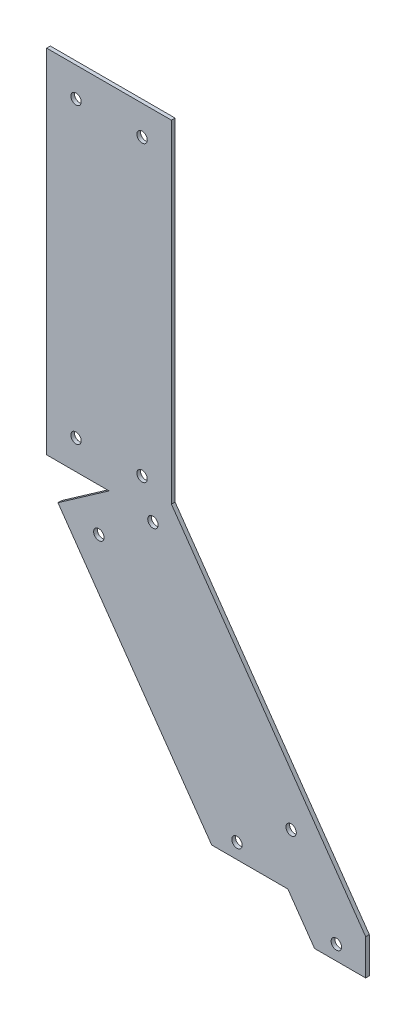
ISO-10303-21;
HEADER;
FILE_DESCRIPTION(('STEP AP214'),'2;1');
FILE_NAME('part.step','',(''),(''),'','','');
FILE_SCHEMA(('AUTOMOTIVE_DESIGN { 1 0 10303 214 1 1 1 1 }'));
ENDSEC;
DATA;
#1=APPLICATION_CONTEXT('core data for automotive mechanical design processes');
#2=APPLICATION_PROTOCOL_DEFINITION('international standard','automotive_design',2000,#1);
#3=PRODUCT_CONTEXT('',#1,'mechanical');
#4=PRODUCT('Part','Part','',(#3));
#5=PRODUCT_RELATED_PRODUCT_CATEGORY('part','',(#4));
#6=PRODUCT_DEFINITION_FORMATION('','',#4);
#7=PRODUCT_DEFINITION_CONTEXT('part definition',#1,'design');
#8=PRODUCT_DEFINITION('design','',#6,#7);
#9=PRODUCT_DEFINITION_SHAPE('','',#8);
#10=(LENGTH_UNIT() NAMED_UNIT(*) SI_UNIT(.MILLI.,.METRE.));
#11=(NAMED_UNIT(*) PLANE_ANGLE_UNIT() SI_UNIT($,.RADIAN.));
#12=(NAMED_UNIT(*) SI_UNIT($,.STERADIAN.) SOLID_ANGLE_UNIT());
#13=UNCERTAINTY_MEASURE_WITH_UNIT(LENGTH_MEASURE(1.E-05),#10,'distance_accuracy_value','');
#14=(GEOMETRIC_REPRESENTATION_CONTEXT(3) GLOBAL_UNCERTAINTY_ASSIGNED_CONTEXT((#13)) GLOBAL_UNIT_ASSIGNED_CONTEXT((#10,
#11,#12)) REPRESENTATION_CONTEXT('',''));
#15=CARTESIAN_POINT('',(0.,0.,0.));
#16=DIRECTION('',(0.,0.,1.));
#17=DIRECTION('',(1.,0.,0.));
#18=AXIS2_PLACEMENT_3D('',#15,#16,#17);
#19=CARTESIAN_POINT('',(22.1068657952492,15.4793940760237,1.5875));
#20=DIRECTION('',(-0.819152044288995,-0.573576436351042,0.));
#21=DIRECTION('',(0.573576436351042,-0.819152044288995,0.));
#22=AXIS2_PLACEMENT_3D('',#19,#20,#21);
#23=PLANE('',#22);
#24=DIRECTION('',(-0.573576436351042,0.819152044288995,0.));
#25=VECTOR('',#24,1.);
#26=CARTESIAN_POINT('',(22.1068657952492,15.4793940760237,0.));
#27=LINE('',#26,#25);
#28=CARTESIAN_POINT('',(111.033223147881,-111.520605923976,0.));
#29=VERTEX_POINT('',#28);
#30=CARTESIAN_POINT('',(26.9875,8.50912606487149,0.));
#31=VERTEX_POINT('',#30);
#32=EDGE_CURVE('E182',#29,#31,#27,.T.);
#33=ORIENTED_EDGE('',*,*,#32,.T.);
#34=DIRECTION('',(0.,0.,-1.));
#35=VECTOR('',#34,1.);
#36=CARTESIAN_POINT('',(26.9875,8.50912606487149,1.5875));
#37=LINE('',#36,#35);
#38=CARTESIAN_POINT('',(26.9875,8.50912606487149,1.5875));
#39=VERTEX_POINT('',#38);
#40=EDGE_CURVE('E11',#39,#31,#37,.T.);
#41=ORIENTED_EDGE('',*,*,#40,.F.);
#42=DIRECTION('',(-0.573576436351042,0.819152044288995,0.));
#43=VECTOR('',#42,1.);
#44=CARTESIAN_POINT('',(22.1068657952492,15.4793940760237,1.5875));
#45=LINE('',#44,#43);
#46=CARTESIAN_POINT('',(111.033223147881,-111.520605923976,1.5875));
#47=VERTEX_POINT('',#46);
#48=EDGE_CURVE('E106',#47,#39,#45,.T.);
#49=ORIENTED_EDGE('',*,*,#48,.F.);
#50=DIRECTION('',(0.,0.,-1.));
#51=VECTOR('',#50,1.);
#52=CARTESIAN_POINT('',(111.033223147881,-111.520605923976,1.5875));
#53=LINE('',#52,#51);
#54=EDGE_CURVE('E181',#47,#29,#53,.T.);
#55=ORIENTED_EDGE('',*,*,#54,.T.);
#56=EDGE_LOOP('',(#33,#41,#49,#55));
#57=FACE_BOUND('',#56,.T.);
#58=ADVANCED_FACE('F41',(#57),#23,.F.);
#59=CARTESIAN_POINT('',(26.9875,0.,1.5875));
#60=DIRECTION('',(1.,0.,0.));
#61=DIRECTION('',(0.,0.,-1.));
#62=AXIS2_PLACEMENT_3D('',#59,#60,#61);
#63=PLANE('',#62);
#64=DIRECTION('',(0.,-1.,0.));
#65=VECTOR('',#64,1.);
#66=CARTESIAN_POINT('',(26.9875,0.,0.));
#67=LINE('',#66,#65);
#68=CARTESIAN_POINT('',(26.9875,152.4,0.));
#69=VERTEX_POINT('',#68);
#70=EDGE_CURVE('E185',#69,#31,#67,.T.);
#71=ORIENTED_EDGE('',*,*,#70,.F.);
#72=DIRECTION('',(0.,0.,-1.));
#73=VECTOR('',#72,1.);
#74=CARTESIAN_POINT('',(26.9875,152.4,1.5875));
#75=LINE('',#74,#73);
#76=CARTESIAN_POINT('',(26.9875,152.4,1.5875));
#77=VERTEX_POINT('',#76);
#78=EDGE_CURVE('E49',#77,#69,#75,.T.);
#79=ORIENTED_EDGE('',*,*,#78,.F.);
#80=DIRECTION('',(0.,-1.,0.));
#81=VECTOR('',#80,1.);
#82=CARTESIAN_POINT('',(26.9875,0.,1.5875));
#83=LINE('',#82,#81);
#84=EDGE_CURVE('E273',#77,#39,#83,.T.);
#85=ORIENTED_EDGE('',*,*,#84,.T.);
#86=ORIENTED_EDGE('',*,*,#40,.T.);
#87=EDGE_LOOP('',(#71,#79,#85,#86));
#88=FACE_BOUND('',#87,.T.);
#89=ADVANCED_FACE('F256',(#88),#63,.T.);
#90=CARTESIAN_POINT('',(0.,152.4,1.5875));
#91=DIRECTION('',(0.,1.,0.));
#92=DIRECTION('',(0.,0.,1.));
#93=AXIS2_PLACEMENT_3D('',#90,#91,#92);
#94=PLANE('',#93);
#95=DIRECTION('',(1.,0.,0.));
#96=VECTOR('',#95,1.);
#97=CARTESIAN_POINT('',(0.,152.4,0.));
#98=LINE('',#97,#96);
#99=CARTESIAN_POINT('',(-26.9875,152.4,0.));
#100=VERTEX_POINT('',#99);
#101=EDGE_CURVE('E188',#100,#69,#98,.T.);
#102=ORIENTED_EDGE('',*,*,#101,.F.);
#103=DIRECTION('',(0.,0.,-1.));
#104=VECTOR('',#103,1.);
#105=CARTESIAN_POINT('',(-26.9875,152.4,1.5875));
#106=LINE('',#105,#104);
#107=CARTESIAN_POINT('',(-26.9875,152.4,1.5875));
#108=VERTEX_POINT('',#107);
#109=EDGE_CURVE('E246',#108,#100,#106,.T.);
#110=ORIENTED_EDGE('',*,*,#109,.F.);
#111=DIRECTION('',(1.,0.,0.));
#112=VECTOR('',#111,1.);
#113=CARTESIAN_POINT('',(0.,152.4,1.5875));
#114=LINE('',#113,#112);
#115=EDGE_CURVE('E253',#108,#77,#114,.T.);
#116=ORIENTED_EDGE('',*,*,#115,.T.);
#117=ORIENTED_EDGE('',*,*,#78,.T.);
#118=EDGE_LOOP('',(#102,#110,#116,#117));
#119=FACE_BOUND('',#118,.T.);
#120=ADVANCED_FACE('F251',(#119),#94,.T.);
#121=CARTESIAN_POINT('',(-26.9875,0.,1.5875));
#122=DIRECTION('',(1.,0.,0.));
#123=DIRECTION('',(0.,0.,-1.));
#124=AXIS2_PLACEMENT_3D('',#121,#122,#123);
#125=PLANE('',#124);
#126=DIRECTION('',(0.,-1.,0.));
#127=VECTOR('',#126,1.);
#128=CARTESIAN_POINT('',(-26.9875,0.,0.));
#129=LINE('',#128,#127);
#130=CARTESIAN_POINT('',(-26.9875,0.,0.));
#131=VERTEX_POINT('',#130);
#132=EDGE_CURVE('E191',#100,#131,#129,.T.);
#133=ORIENTED_EDGE('',*,*,#132,.T.);
#134=DIRECTION('',(0.,0.,-1.));
#135=VECTOR('',#134,1.);
#136=CARTESIAN_POINT('',(-26.9875,0.,1.5875));
#137=LINE('',#136,#135);
#138=CARTESIAN_POINT('',(-26.9875,0.,1.5875));
#139=VERTEX_POINT('',#138);
#140=EDGE_CURVE('E244',#139,#131,#137,.T.);
#141=ORIENTED_EDGE('',*,*,#140,.F.);
#142=DIRECTION('',(0.,-1.,0.));
#143=VECTOR('',#142,1.);
#144=CARTESIAN_POINT('',(-26.9875,0.,1.5875));
#145=LINE('',#144,#143);
#146=EDGE_CURVE('E269',#108,#139,#145,.T.);
#147=ORIENTED_EDGE('',*,*,#146,.F.);
#148=ORIENTED_EDGE('',*,*,#109,.T.);
#149=EDGE_LOOP('',(#133,#141,#147,#148));
#150=FACE_BOUND('',#149,.T.);
#151=ADVANCED_FACE('F266',(#150),#125,.F.);
#152=CARTESIAN_POINT('',(0.,0.,1.5875));
#153=DIRECTION('',(0.,-1.,0.));
#154=DIRECTION('',(1.,0.,0.));
#155=AXIS2_PLACEMENT_3D('',#152,#153,#154);
#156=PLANE('',#155);
#157=DIRECTION('',(-1.,0.,0.));
#158=VECTOR('',#157,1.);
#159=CARTESIAN_POINT('',(0.,0.,0.));
#160=LINE('',#159,#158);
#161=CARTESIAN_POINT('',(0.,0.,0.));
#162=VERTEX_POINT('',#161);
#163=EDGE_CURVE('E194',#162,#131,#160,.T.);
#164=ORIENTED_EDGE('',*,*,#163,.F.);
#165=DIRECTION('',(0.,0.,-1.));
#166=VECTOR('',#165,1.);
#167=CARTESIAN_POINT('',(0.,0.,1.5875));
#168=LINE('',#167,#166);
#169=CARTESIAN_POINT('',(0.,0.,1.5875));
#170=VERTEX_POINT('',#169);
#171=EDGE_CURVE('E242',#170,#162,#168,.T.);
#172=ORIENTED_EDGE('',*,*,#171,.F.);
#173=DIRECTION('',(-1.,0.,0.));
#174=VECTOR('',#173,1.);
#175=CARTESIAN_POINT('',(0.,0.,1.5875));
#176=LINE('',#175,#174);
#177=EDGE_CURVE('E271',#170,#139,#176,.T.);
#178=ORIENTED_EDGE('',*,*,#177,.T.);
#179=ORIENTED_EDGE('',*,*,#140,.T.);
#180=EDGE_LOOP('',(#164,#172,#178,#179));
#181=FACE_BOUND('',#180,.T.);
#182=ADVANCED_FACE('F319',(#181),#156,.T.);
#183=CARTESIAN_POINT('',(0.,0.,1.5875));
#184=DIRECTION('',(0.573576436351042,-0.819152044288995,0.));
#185=DIRECTION('',(0.819152044288995,0.573576436351042,0.));
#186=AXIS2_PLACEMENT_3D('',#183,#184,#185);
#187=PLANE('',#186);
#188=DIRECTION('',(-0.819152044288995,-0.573576436351042,0.));
#189=VECTOR('',#188,1.);
#190=CARTESIAN_POINT('',(0.,0.,0.));
#191=LINE('',#190,#189);
#192=CARTESIAN_POINT('',(-22.1068657952493,-15.4793940760237,0.));
#193=VERTEX_POINT('',#192);
#194=EDGE_CURVE('E197',#162,#193,#191,.T.);
#195=ORIENTED_EDGE('',*,*,#194,.T.);
#196=DIRECTION('',(0.,0.,-1.));
#197=VECTOR('',#196,1.);
#198=CARTESIAN_POINT('',(-22.1068657952493,-15.4793940760237,1.5875));
#199=LINE('',#198,#197);
#200=CARTESIAN_POINT('',(-22.1068657952493,-15.4793940760237,1.5875));
#201=VERTEX_POINT('',#200);
#202=EDGE_CURVE('E239',#201,#193,#199,.T.);
#203=ORIENTED_EDGE('',*,*,#202,.F.);
#204=DIRECTION('',(-0.819152044288995,-0.573576436351042,0.));
#205=VECTOR('',#204,1.);
#206=CARTESIAN_POINT('',(0.,0.,1.5875));
#207=LINE('',#206,#205);
#208=EDGE_CURVE('E279',#170,#201,#207,.T.);
#209=ORIENTED_EDGE('',*,*,#208,.F.);
#210=ORIENTED_EDGE('',*,*,#171,.T.);
#211=EDGE_LOOP('',(#195,#203,#209,#210));
#212=FACE_BOUND('',#211,.T.);
#213=ADVANCED_FACE('F322',(#212),#187,.F.);
#214=CARTESIAN_POINT('',(-22.1068657952493,-15.4793940760237,1.5875));
#215=DIRECTION('',(0.819152044288995,0.573576436351042,0.));
#216=DIRECTION('',(-0.573576436351042,0.819152044288995,0.));
#217=AXIS2_PLACEMENT_3D('',#214,#215,#216);
#218=PLANE('',#217);
#219=DIRECTION('',(0.573576436351042,-0.819152044288995,0.));
#220=VECTOR('',#219,1.);
#221=CARTESIAN_POINT('',(-22.1068657952493,-15.4793940760237,0.));
#222=LINE('',#221,#220);
#223=CARTESIAN_POINT('',(44.4202766825903,-110.49,0.));
#224=VERTEX_POINT('',#223);
#225=EDGE_CURVE('E199',#193,#224,#222,.T.);
#226=ORIENTED_EDGE('',*,*,#225,.T.);
#227=DIRECTION('',(0.,0.,-1.));
#228=VECTOR('',#227,1.);
#229=CARTESIAN_POINT('',(44.4202766825903,-110.49,1.5875));
#230=LINE('',#229,#228);
#231=CARTESIAN_POINT('',(44.4202766825903,-110.49,1.5875));
#232=VERTEX_POINT('',#231);
#233=EDGE_CURVE('E236',#232,#224,#230,.T.);
#234=ORIENTED_EDGE('',*,*,#233,.F.);
#235=DIRECTION('',(0.573576436351042,-0.819152044288995,0.));
#236=VECTOR('',#235,1.);
#237=CARTESIAN_POINT('',(-22.1068657952493,-15.4793940760237,1.5875));
#238=LINE('',#237,#236);
#239=EDGE_CURVE('E281',#201,#232,#238,.T.);
#240=ORIENTED_EDGE('',*,*,#239,.F.);
#241=ORIENTED_EDGE('',*,*,#202,.T.);
#242=EDGE_LOOP('',(#226,#234,#240,#241));
#243=FACE_BOUND('',#242,.T.);
#244=ADVANCED_FACE('F287',(#243),#218,.F.);
#245=CARTESIAN_POINT('',(0.,-110.49,1.5875));
#246=DIRECTION('',(0.,1.,0.));
#247=DIRECTION('',(0.,0.,1.));
#248=AXIS2_PLACEMENT_3D('',#245,#246,#247);
#249=PLANE('',#248);
#250=DIRECTION('',(1.,0.,0.));
#251=VECTOR('',#250,1.);
#252=CARTESIAN_POINT('',(0.,-110.49,0.));
#253=LINE('',#252,#251);
#254=CARTESIAN_POINT('',(77.36593089679,-110.49,0.));
#255=VERTEX_POINT('',#254);
#256=EDGE_CURVE('E201',#224,#255,#253,.T.);
#257=ORIENTED_EDGE('',*,*,#256,.T.);
#258=DIRECTION('',(0.,0.,-1.));
#259=VECTOR('',#258,1.);
#260=CARTESIAN_POINT('',(77.36593089679,-110.49,1.5875));
#261=LINE('',#260,#259);
#262=CARTESIAN_POINT('',(77.36593089679,-110.49,1.5875));
#263=VERTEX_POINT('',#262);
#264=EDGE_CURVE('E146',#263,#255,#261,.T.);
#265=ORIENTED_EDGE('',*,*,#264,.F.);
#266=DIRECTION('',(1.,0.,0.));
#267=VECTOR('',#266,1.);
#268=CARTESIAN_POINT('',(0.,-110.49,1.5875));
#269=LINE('',#268,#267);
#270=EDGE_CURVE('E137',#232,#263,#269,.T.);
#271=ORIENTED_EDGE('',*,*,#270,.F.);
#272=ORIENTED_EDGE('',*,*,#233,.T.);
#273=EDGE_LOOP('',(#257,#265,#271,#272));
#274=FACE_BOUND('',#273,.T.);
#275=ADVANCED_FACE('F291',(#274),#249,.F.);
#276=CARTESIAN_POINT('',(0.,0.,1.5875));
#277=DIRECTION('',(0.819152044288995,0.573576436351042,0.));
#278=DIRECTION('',(-0.573576436351042,0.819152044288995,0.));
#279=AXIS2_PLACEMENT_3D('',#276,#277,#278);
#280=PLANE('',#279);
#281=DIRECTION('',(0.573576436351042,-0.819152044288995,0.));
#282=VECTOR('',#281,1.);
#283=CARTESIAN_POINT('',(0.,0.,0.));
#284=LINE('',#283,#282);
#285=CARTESIAN_POINT('',(88.9263573526322,-127.,0.));
#286=VERTEX_POINT('',#285);
#287=EDGE_CURVE('E145',#255,#286,#284,.T.);
#288=ORIENTED_EDGE('',*,*,#287,.T.);
#289=DIRECTION('',(0.,0.,-1.));
#290=VECTOR('',#289,1.);
#291=CARTESIAN_POINT('',(88.9263573526322,-127.,1.5875));
#292=LINE('',#291,#290);
#293=CARTESIAN_POINT('',(88.9263573526322,-127.,1.5875));
#294=VERTEX_POINT('',#293);
#295=EDGE_CURVE('E142',#294,#286,#292,.T.);
#296=ORIENTED_EDGE('',*,*,#295,.F.);
#297=DIRECTION('',(0.573576436351042,-0.819152044288995,0.));
#298=VECTOR('',#297,1.);
#299=CARTESIAN_POINT('',(0.,0.,1.5875));
#300=LINE('',#299,#298);
#301=EDGE_CURVE('E130',#263,#294,#300,.T.);
#302=ORIENTED_EDGE('',*,*,#301,.F.);
#303=ORIENTED_EDGE('',*,*,#264,.T.);
#304=EDGE_LOOP('',(#288,#296,#302,#303));
#305=FACE_BOUND('',#304,.T.);
#306=ADVANCED_FACE('F143',(#305),#280,.F.);
#307=CARTESIAN_POINT('',(0.,-127.,1.5875));
#308=DIRECTION('',(0.,1.,0.));
#309=DIRECTION('',(0.,0.,1.));
#310=AXIS2_PLACEMENT_3D('',#307,#308,#309);
#311=PLANE('',#310);
#312=DIRECTION('',(1.,0.,0.));
#313=VECTOR('',#312,1.);
#314=CARTESIAN_POINT('',(0.,-127.,0.));
#315=LINE('',#314,#313);
#316=CARTESIAN_POINT('',(111.033223147881,-127.,0.));
#317=VERTEX_POINT('',#316);
#318=EDGE_CURVE('E94',#286,#317,#315,.T.);
#319=ORIENTED_EDGE('',*,*,#318,.T.);
#320=DIRECTION('',(0.,0.,-1.));
#321=VECTOR('',#320,1.);
#322=CARTESIAN_POINT('',(111.033223147881,-127.,1.5875));
#323=LINE('',#322,#321);
#324=CARTESIAN_POINT('',(111.033223147881,-127.,1.5875));
#325=VERTEX_POINT('',#324);
#326=EDGE_CURVE('E147',#325,#317,#323,.T.);
#327=ORIENTED_EDGE('',*,*,#326,.F.);
#328=DIRECTION('',(1.,0.,0.));
#329=VECTOR('',#328,1.);
#330=CARTESIAN_POINT('',(0.,-127.,1.5875));
#331=LINE('',#330,#329);
#332=EDGE_CURVE('E135',#294,#325,#331,.T.);
#333=ORIENTED_EDGE('',*,*,#332,.F.);
#334=ORIENTED_EDGE('',*,*,#295,.T.);
#335=EDGE_LOOP('',(#319,#327,#333,#334));
#336=FACE_BOUND('',#335,.T.);
#337=ADVANCED_FACE('F149',(#336),#311,.F.);
#338=CARTESIAN_POINT('',(-14.2875,12.7,1.5875));
#339=DIRECTION('',(0.,0.,-1.));
#340=DIRECTION('',(-1.,0.,0.));
#341=AXIS2_PLACEMENT_3D('',#338,#339,#340);
#342=CYLINDRICAL_SURFACE('',#341,2.25);
#343=CARTESIAN_POINT('',(-14.2875,12.7,1.5875));
#344=DIRECTION('',(0.,0.,1.));
#345=DIRECTION('',(1.,0.,0.));
#346=AXIS2_PLACEMENT_3D('',#343,#344,#345);
#347=CIRCLE('',#346,2.25);
#348=CARTESIAN_POINT('',(-12.0375,12.7,1.5875));
#349=VERTEX_POINT('',#348);
#350=EDGE_CURVE('E175',#349,#349,#347,.T.);
#351=ORIENTED_EDGE('',*,*,#350,.T.);
#352=EDGE_LOOP('',(#351));
#353=FACE_BOUND('',#352,.T.);
#354=CARTESIAN_POINT('',(-14.2875,12.7,0.));
#355=DIRECTION('',(0.,0.,1.));
#356=DIRECTION('',(1.,0.,0.));
#357=AXIS2_PLACEMENT_3D('',#354,#355,#356);
#358=CIRCLE('',#357,2.25);
#359=CARTESIAN_POINT('',(-12.0375,12.7,0.));
#360=VERTEX_POINT('',#359);
#361=EDGE_CURVE('E227',#360,#360,#358,.T.);
#362=ORIENTED_EDGE('',*,*,#361,.F.);
#363=EDGE_LOOP('',(#362));
#364=FACE_BOUND('',#363,.T.);
#365=ADVANCED_FACE('F333',(#353,#364),#342,.F.);
#366=CARTESIAN_POINT('',(14.2875,139.7,1.5875));
#367=DIRECTION('',(0.,0.,-1.));
#368=DIRECTION('',(-1.,0.,0.));
#369=AXIS2_PLACEMENT_3D('',#366,#367,#368);
#370=CYLINDRICAL_SURFACE('',#369,2.25);
#371=CARTESIAN_POINT('',(14.2875,139.7,1.5875));
#372=DIRECTION('',(0.,0.,1.));
#373=DIRECTION('',(1.,0.,0.));
#374=AXIS2_PLACEMENT_3D('',#371,#372,#373);
#375=CIRCLE('',#374,2.25);
#376=CARTESIAN_POINT('',(16.5375,139.7,1.5875));
#377=VERTEX_POINT('',#376);
#378=EDGE_CURVE('E172',#377,#377,#375,.F.);
#379=ORIENTED_EDGE('',*,*,#378,.F.);
#380=EDGE_LOOP('',(#379));
#381=FACE_BOUND('',#380,.T.);
#382=CARTESIAN_POINT('',(14.2875,139.7,0.));
#383=DIRECTION('',(0.,0.,1.));
#384=DIRECTION('',(1.,0.,0.));
#385=AXIS2_PLACEMENT_3D('',#382,#383,#384);
#386=CIRCLE('',#385,2.25);
#387=CARTESIAN_POINT('',(16.5375,139.7,0.));
#388=VERTEX_POINT('',#387);
#389=EDGE_CURVE('E224',#388,#388,#386,.F.);
#390=ORIENTED_EDGE('',*,*,#389,.T.);
#391=EDGE_LOOP('',(#390));
#392=FACE_BOUND('',#391,.T.);
#393=ADVANCED_FACE('F337',(#381,#392),#370,.F.);
#394=CARTESIAN_POINT('',(-4.41921409112079,-18.5982042968357,1.5875));
#395=DIRECTION('',(0.,0.,-1.));
#396=DIRECTION('',(-1.,0.,0.));
#397=AXIS2_PLACEMENT_3D('',#394,#395,#396);
#398=CYLINDRICAL_SURFACE('',#397,2.25);
#399=CARTESIAN_POINT('',(-4.41921409112079,-18.5982042968357,1.5875));
#400=DIRECTION('',(0.,0.,1.));
#401=DIRECTION('',(1.,0.,0.));
#402=AXIS2_PLACEMENT_3D('',#399,#400,#401);
#403=CIRCLE('',#402,2.25);
#404=CARTESIAN_POINT('',(-2.16921409112079,-18.5982042968357,1.5875));
#405=VERTEX_POINT('',#404);
#406=EDGE_CURVE('E169',#405,#405,#403,.T.);
#407=ORIENTED_EDGE('',*,*,#406,.T.);
#408=EDGE_LOOP('',(#407));
#409=FACE_BOUND('',#408,.T.);
#410=CARTESIAN_POINT('',(-4.41921409112079,-18.5982042968357,0.));
#411=DIRECTION('',(0.,0.,1.));
#412=DIRECTION('',(1.,0.,0.));
#413=AXIS2_PLACEMENT_3D('',#410,#411,#412);
#414=CIRCLE('',#413,2.25);
#415=CARTESIAN_POINT('',(-2.16921409112079,-18.5982042968357,0.));
#416=VERTEX_POINT('',#415);
#417=EDGE_CURVE('E221',#416,#416,#414,.T.);
#418=ORIENTED_EDGE('',*,*,#417,.F.);
#419=EDGE_LOOP('',(#418));
#420=FACE_BOUND('',#419,.T.);
#421=ADVANCED_FACE('F343',(#409,#420),#398,.F.);
#422=CARTESIAN_POINT('',(55.3694602948785,-103.985280446955,1.5875));
#423=DIRECTION('',(0.,0.,-1.));
#424=DIRECTION('',(-1.,0.,0.));
#425=AXIS2_PLACEMENT_3D('',#422,#423,#424);
#426=CYLINDRICAL_SURFACE('',#425,2.25);
#427=CARTESIAN_POINT('',(55.3694602948785,-103.985280446955,1.5875));
#428=DIRECTION('',(0.,0.,1.));
#429=DIRECTION('',(1.,0.,0.));
#430=AXIS2_PLACEMENT_3D('',#427,#428,#429);
#431=CIRCLE('',#430,2.25);
#432=CARTESIAN_POINT('',(57.6194602948785,-103.985280446955,1.5875));
#433=VERTEX_POINT('',#432);
#434=EDGE_CURVE('E166',#433,#433,#431,.T.);
#435=ORIENTED_EDGE('',*,*,#434,.T.);
#436=EDGE_LOOP('',(#435));
#437=FACE_BOUND('',#436,.T.);
#438=CARTESIAN_POINT('',(55.3694602948785,-103.985280446955,0.));
#439=DIRECTION('',(0.,0.,1.));
#440=DIRECTION('',(1.,0.,0.));
#441=AXIS2_PLACEMENT_3D('',#438,#439,#440);
#442=CIRCLE('',#441,2.25);
#443=CARTESIAN_POINT('',(57.6194602948785,-103.985280446955,0.));
#444=VERTEX_POINT('',#443);
#445=EDGE_CURVE('E218',#444,#444,#442,.T.);
#446=ORIENTED_EDGE('',*,*,#445,.F.);
#447=EDGE_LOOP('',(#446));
#448=FACE_BOUND('',#447,.T.);
#449=ADVANCED_FACE('F351',(#437,#448),#426,.F.);
#450=CARTESIAN_POINT('',(78.7767299604365,-87.5953337782238,1.5875));
#451=DIRECTION('',(0.,0.,-1.));
#452=DIRECTION('',(-1.,0.,0.));
#453=AXIS2_PLACEMENT_3D('',#450,#451,#452);
#454=CYLINDRICAL_SURFACE('',#453,2.25000000000001);
#455=CARTESIAN_POINT('',(78.7767299604365,-87.5953337782238,1.5875));
#456=DIRECTION('',(0.,0.,1.));
#457=DIRECTION('',(1.,0.,0.));
#458=AXIS2_PLACEMENT_3D('',#455,#456,#457);
#459=CIRCLE('',#458,2.25000000000001);
#460=CARTESIAN_POINT('',(81.0267299604365,-87.5953337782238,1.5875));
#461=VERTEX_POINT('',#460);
#462=EDGE_CURVE('E163',#461,#461,#459,.F.);
#463=ORIENTED_EDGE('',*,*,#462,.F.);
#464=EDGE_LOOP('',(#463));
#465=FACE_BOUND('',#464,.T.);
#466=CARTESIAN_POINT('',(78.7767299604365,-87.5953337782238,0.));
#467=DIRECTION('',(0.,0.,1.));
#468=DIRECTION('',(1.,0.,0.));
#469=AXIS2_PLACEMENT_3D('',#466,#467,#468);
#470=CIRCLE('',#469,2.25000000000001);
#471=CARTESIAN_POINT('',(81.0267299604365,-87.5953337782238,0.));
#472=VERTEX_POINT('',#471);
#473=EDGE_CURVE('E215',#472,#472,#470,.F.);
#474=ORIENTED_EDGE('',*,*,#473,.T.);
#475=EDGE_LOOP('',(#474));
#476=FACE_BOUND('',#475,.T.);
#477=ADVANCED_FACE('F355',(#465,#476),#454,.F.);
#478=CARTESIAN_POINT('',(18.9880555744372,-2.20825762810472,1.5875));
#479=DIRECTION('',(0.,0.,-1.));
#480=DIRECTION('',(-1.,0.,0.));
#481=AXIS2_PLACEMENT_3D('',#478,#479,#480);
#482=CYLINDRICAL_SURFACE('',#481,2.25);
#483=CARTESIAN_POINT('',(18.9880555744372,-2.20825762810472,1.5875));
#484=DIRECTION('',(0.,0.,1.));
#485=DIRECTION('',(1.,0.,0.));
#486=AXIS2_PLACEMENT_3D('',#483,#484,#485);
#487=CIRCLE('',#486,2.25);
#488=CARTESIAN_POINT('',(21.2380555744372,-2.20825762810472,1.5875));
#489=VERTEX_POINT('',#488);
#490=EDGE_CURVE('E160',#489,#489,#487,.F.);
#491=ORIENTED_EDGE('',*,*,#490,.F.);
#492=EDGE_LOOP('',(#491));
#493=FACE_BOUND('',#492,.T.);
#494=CARTESIAN_POINT('',(18.9880555744372,-2.20825762810472,0.));
#495=DIRECTION('',(0.,0.,1.));
#496=DIRECTION('',(1.,0.,0.));
#497=AXIS2_PLACEMENT_3D('',#494,#495,#496);
#498=CIRCLE('',#497,2.25);
#499=CARTESIAN_POINT('',(21.2380555744372,-2.20825762810472,0.));
#500=VERTEX_POINT('',#499);
#501=EDGE_CURVE('E212',#500,#500,#498,.F.);
#502=ORIENTED_EDGE('',*,*,#501,.T.);
#503=EDGE_LOOP('',(#502));
#504=FACE_BOUND('',#503,.T.);
#505=ADVANCED_FACE('F359',(#493,#504),#482,.F.);
#506=CARTESIAN_POINT('',(98.3332231478814,-120.65,1.5875));
#507=DIRECTION('',(0.,0.,-1.));
#508=DIRECTION('',(-1.,0.,0.));
#509=AXIS2_PLACEMENT_3D('',#506,#507,#508);
#510=CYLINDRICAL_SURFACE('',#509,2.25);
#511=CARTESIAN_POINT('',(98.3332231478814,-120.65,1.5875));
#512=DIRECTION('',(0.,0.,1.));
#513=DIRECTION('',(1.,0.,0.));
#514=AXIS2_PLACEMENT_3D('',#511,#512,#513);
#515=CIRCLE('',#514,2.25);
#516=CARTESIAN_POINT('',(100.583223147881,-120.65,1.5875));
#517=VERTEX_POINT('',#516);
#518=EDGE_CURVE('E157',#517,#517,#515,.T.);
#519=ORIENTED_EDGE('',*,*,#518,.T.);
#520=EDGE_LOOP('',(#519));
#521=FACE_BOUND('',#520,.T.);
#522=CARTESIAN_POINT('',(98.3332231478814,-120.65,0.));
#523=DIRECTION('',(0.,0.,1.));
#524=DIRECTION('',(1.,0.,0.));
#525=AXIS2_PLACEMENT_3D('',#522,#523,#524);
#526=CIRCLE('',#525,2.25);
#527=CARTESIAN_POINT('',(100.583223147881,-120.65,0.));
#528=VERTEX_POINT('',#527);
#529=EDGE_CURVE('E209',#528,#528,#526,.T.);
#530=ORIENTED_EDGE('',*,*,#529,.F.);
#531=EDGE_LOOP('',(#530));
#532=FACE_BOUND('',#531,.T.);
#533=ADVANCED_FACE('F304',(#521,#532),#510,.F.);
#534=CARTESIAN_POINT('',(14.2875,12.7,1.5875));
#535=DIRECTION('',(0.,0.,-1.));
#536=DIRECTION('',(-1.,0.,0.));
#537=AXIS2_PLACEMENT_3D('',#534,#535,#536);
#538=CYLINDRICAL_SURFACE('',#537,2.25);
#539=CARTESIAN_POINT('',(14.2875,12.7,1.5875));
#540=DIRECTION('',(0.,0.,1.));
#541=DIRECTION('',(1.,0.,0.));
#542=AXIS2_PLACEMENT_3D('',#539,#540,#541);
#543=CIRCLE('',#542,2.25);
#544=CARTESIAN_POINT('',(16.5375,12.7,1.5875));
#545=VERTEX_POINT('',#544);
#546=EDGE_CURVE('E151',#545,#545,#543,.F.);
#547=ORIENTED_EDGE('',*,*,#546,.F.);
#548=EDGE_LOOP('',(#547));
#549=FACE_BOUND('',#548,.T.);
#550=CARTESIAN_POINT('',(14.2875,12.7,0.));
#551=DIRECTION('',(0.,0.,1.));
#552=DIRECTION('',(1.,0.,0.));
#553=AXIS2_PLACEMENT_3D('',#550,#551,#552);
#554=CIRCLE('',#553,2.25);
#555=CARTESIAN_POINT('',(16.5375,12.7,0.));
#556=VERTEX_POINT('',#555);
#557=EDGE_CURVE('E206',#556,#556,#554,.F.);
#558=ORIENTED_EDGE('',*,*,#557,.T.);
#559=EDGE_LOOP('',(#558));
#560=FACE_BOUND('',#559,.T.);
#561=ADVANCED_FACE('F296',(#549,#560),#538,.F.);
#562=CARTESIAN_POINT('',(111.033223147881,0.,1.5875));
#563=DIRECTION('',(-1.,0.,0.));
#564=DIRECTION('',(0.,0.,1.));
#565=AXIS2_PLACEMENT_3D('',#562,#563,#564);
#566=PLANE('',#565);
#567=DIRECTION('',(0.,1.,0.));
#568=VECTOR('',#567,1.);
#569=CARTESIAN_POINT('',(111.033223147881,0.,0.));
#570=LINE('',#569,#568);
#571=EDGE_CURVE('E100',#317,#29,#570,.T.);
#572=ORIENTED_EDGE('',*,*,#571,.T.);
#573=ORIENTED_EDGE('',*,*,#54,.F.);
#574=DIRECTION('',(0.,1.,0.));
#575=VECTOR('',#574,1.);
#576=CARTESIAN_POINT('',(111.033223147881,0.,1.5875));
#577=LINE('',#576,#575);
#578=EDGE_CURVE('E57',#325,#47,#577,.T.);
#579=ORIENTED_EDGE('',*,*,#578,.F.);
#580=ORIENTED_EDGE('',*,*,#326,.T.);
#581=EDGE_LOOP('',(#572,#573,#579,#580));
#582=FACE_BOUND('',#581,.T.);
#583=ADVANCED_FACE('F293',(#582),#566,.F.);
#584=CARTESIAN_POINT('',(-14.2875,139.7,1.5875));
#585=DIRECTION('',(0.,0.,-1.));
#586=DIRECTION('',(-1.,0.,0.));
#587=AXIS2_PLACEMENT_3D('',#584,#585,#586);
#588=CYLINDRICAL_SURFACE('',#587,2.25);
#589=CARTESIAN_POINT('',(-14.2875,139.7,1.5875));
#590=DIRECTION('',(0.,0.,1.));
#591=DIRECTION('',(1.,0.,0.));
#592=AXIS2_PLACEMENT_3D('',#589,#590,#591);
#593=CIRCLE('',#592,2.25);
#594=CARTESIAN_POINT('',(-12.0375,139.7,1.5875));
#595=VERTEX_POINT('',#594);
#596=EDGE_CURVE('E178',#595,#595,#593,.T.);
#597=ORIENTED_EDGE('',*,*,#596,.T.);
#598=EDGE_LOOP('',(#597));
#599=FACE_BOUND('',#598,.T.);
#600=CARTESIAN_POINT('',(-14.2875,139.7,0.));
#601=DIRECTION('',(0.,0.,1.));
#602=DIRECTION('',(1.,0.,0.));
#603=AXIS2_PLACEMENT_3D('',#600,#601,#602);
#604=CIRCLE('',#603,2.25);
#605=CARTESIAN_POINT('',(-12.0375,139.7,0.));
#606=VERTEX_POINT('',#605);
#607=EDGE_CURVE('E230',#606,#606,#604,.T.);
#608=ORIENTED_EDGE('',*,*,#607,.F.);
#609=EDGE_LOOP('',(#608));
#610=FACE_BOUND('',#609,.T.);
#611=ADVANCED_FACE('F295',(#599,#610),#588,.F.);
#612=CARTESIAN_POINT('',(0.,0.,1.5875));
#613=DIRECTION('',(0.,0.,1.));
#614=DIRECTION('',(1.,0.,0.));
#615=AXIS2_PLACEMENT_3D('',#612,#613,#614);
#616=PLANE('',#615);
#617=ORIENTED_EDGE('',*,*,#48,.T.);
#618=ORIENTED_EDGE('',*,*,#84,.F.);
#619=ORIENTED_EDGE('',*,*,#115,.F.);
#620=ORIENTED_EDGE('',*,*,#146,.T.);
#621=ORIENTED_EDGE('',*,*,#177,.F.);
#622=ORIENTED_EDGE('',*,*,#208,.T.);
#623=ORIENTED_EDGE('',*,*,#239,.T.);
#624=ORIENTED_EDGE('',*,*,#270,.T.);
#625=ORIENTED_EDGE('',*,*,#301,.T.);
#626=ORIENTED_EDGE('',*,*,#332,.T.);
#627=ORIENTED_EDGE('',*,*,#578,.T.);
#628=EDGE_LOOP('',(#617,#618,#619,#620,#621,#622,#623,#624,#625,#626,#627));
#629=FACE_BOUND('',#628,.T.);
#630=ORIENTED_EDGE('',*,*,#546,.T.);
#631=EDGE_LOOP('',(#630));
#632=FACE_BOUND('',#631,.T.);
#633=ORIENTED_EDGE('',*,*,#518,.F.);
#634=EDGE_LOOP('',(#633));
#635=FACE_BOUND('',#634,.T.);
#636=ORIENTED_EDGE('',*,*,#490,.T.);
#637=EDGE_LOOP('',(#636));
#638=FACE_BOUND('',#637,.T.);
#639=ORIENTED_EDGE('',*,*,#462,.T.);
#640=EDGE_LOOP('',(#639));
#641=FACE_BOUND('',#640,.T.);
#642=ORIENTED_EDGE('',*,*,#434,.F.);
#643=EDGE_LOOP('',(#642));
#644=FACE_BOUND('',#643,.T.);
#645=ORIENTED_EDGE('',*,*,#406,.F.);
#646=EDGE_LOOP('',(#645));
#647=FACE_BOUND('',#646,.T.);
#648=ORIENTED_EDGE('',*,*,#378,.T.);
#649=EDGE_LOOP('',(#648));
#650=FACE_BOUND('',#649,.T.);
#651=ORIENTED_EDGE('',*,*,#350,.F.);
#652=EDGE_LOOP('',(#651));
#653=FACE_BOUND('',#652,.T.);
#654=ORIENTED_EDGE('',*,*,#596,.F.);
#655=EDGE_LOOP('',(#654));
#656=FACE_BOUND('',#655,.T.);
#657=ADVANCED_FACE('F132',(#629,#632,#635,#638,#641,#644,#647,#650,#653,#656),#616,.T.);
#658=CARTESIAN_POINT('',(0.,0.,0.));
#659=DIRECTION('',(0.,0.,1.));
#660=DIRECTION('',(1.,0.,0.));
#661=AXIS2_PLACEMENT_3D('',#658,#659,#660);
#662=PLANE('',#661);
#663=ORIENTED_EDGE('',*,*,#32,.F.);
#664=ORIENTED_EDGE('',*,*,#571,.F.);
#665=ORIENTED_EDGE('',*,*,#318,.F.);
#666=ORIENTED_EDGE('',*,*,#287,.F.);
#667=ORIENTED_EDGE('',*,*,#256,.F.);
#668=ORIENTED_EDGE('',*,*,#225,.F.);
#669=ORIENTED_EDGE('',*,*,#194,.F.);
#670=ORIENTED_EDGE('',*,*,#163,.T.);
#671=ORIENTED_EDGE('',*,*,#132,.F.);
#672=ORIENTED_EDGE('',*,*,#101,.T.);
#673=ORIENTED_EDGE('',*,*,#70,.T.);
#674=EDGE_LOOP('',(#663,#664,#665,#666,#667,#668,#669,#670,#671,#672,#673));
#675=FACE_BOUND('',#674,.T.);
#676=ORIENTED_EDGE('',*,*,#557,.F.);
#677=EDGE_LOOP('',(#676));
#678=FACE_BOUND('',#677,.T.);
#679=ORIENTED_EDGE('',*,*,#529,.T.);
#680=EDGE_LOOP('',(#679));
#681=FACE_BOUND('',#680,.T.);
#682=ORIENTED_EDGE('',*,*,#501,.F.);
#683=EDGE_LOOP('',(#682));
#684=FACE_BOUND('',#683,.T.);
#685=ORIENTED_EDGE('',*,*,#473,.F.);
#686=EDGE_LOOP('',(#685));
#687=FACE_BOUND('',#686,.T.);
#688=ORIENTED_EDGE('',*,*,#445,.T.);
#689=EDGE_LOOP('',(#688));
#690=FACE_BOUND('',#689,.T.);
#691=ORIENTED_EDGE('',*,*,#417,.T.);
#692=EDGE_LOOP('',(#691));
#693=FACE_BOUND('',#692,.T.);
#694=ORIENTED_EDGE('',*,*,#389,.F.);
#695=EDGE_LOOP('',(#694));
#696=FACE_BOUND('',#695,.T.);
#697=ORIENTED_EDGE('',*,*,#361,.T.);
#698=EDGE_LOOP('',(#697));
#699=FACE_BOUND('',#698,.T.);
#700=ORIENTED_EDGE('',*,*,#607,.T.);
#701=EDGE_LOOP('',(#700));
#702=FACE_BOUND('',#701,.T.);
#703=ADVANCED_FACE('F260',(#675,#678,#681,#684,#687,#690,#693,#696,#699,#702),#662,.F.);
#704=CLOSED_SHELL('',(#58,#89,#120,#151,#182,#213,#244,#275,#306,#337,#365,#393,#421,#449,#477,
#505,#533,#561,#583,#611,#657,#703));
#705=MANIFOLD_SOLID_BREP('B2',#704);
#706=ADVANCED_BREP_SHAPE_REPRESENTATION('',(#18,#705),#14);
#707=SHAPE_DEFINITION_REPRESENTATION(#9,#706);
ENDSEC;
END-ISO-10303-21;
